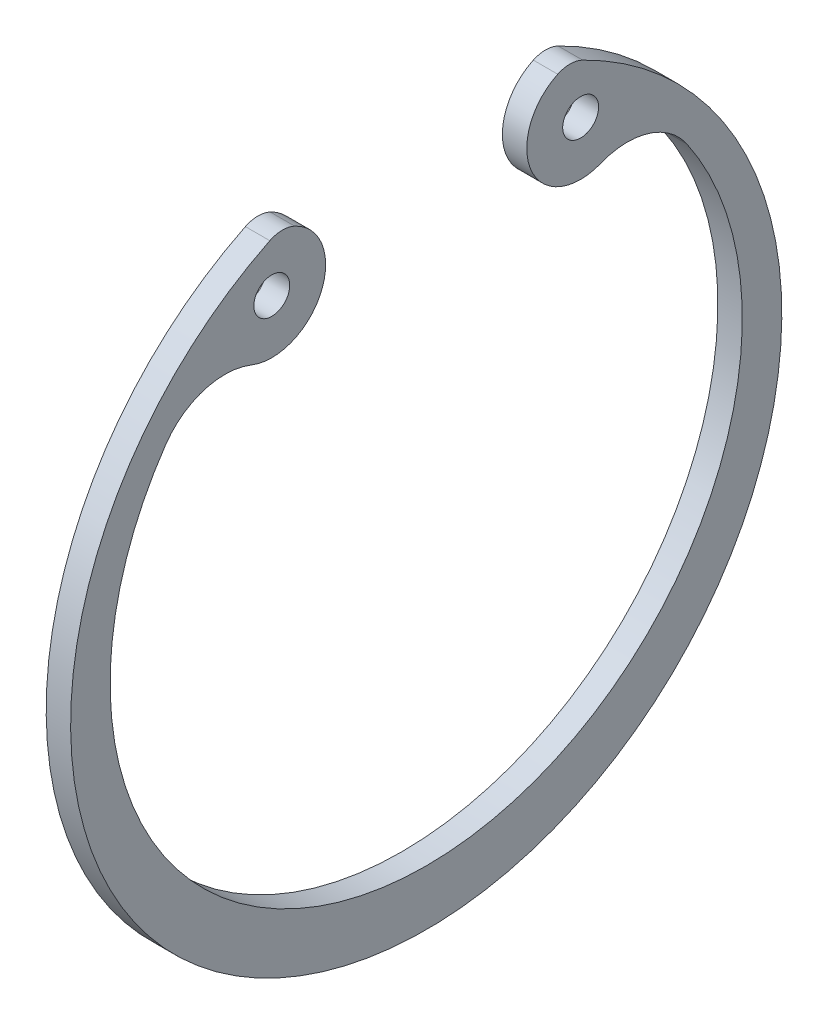
ISO-10303-21;
HEADER;
FILE_DESCRIPTION(('STEP AP214'),'2;1');
FILE_NAME('part.step','',(''),(''),'','','');
FILE_SCHEMA(('AUTOMOTIVE_DESIGN { 1 0 10303 214 1 1 1 1 }'));
ENDSEC;
DATA;
#1=APPLICATION_CONTEXT('core data for automotive mechanical design processes');
#2=APPLICATION_PROTOCOL_DEFINITION('international standard','automotive_design',2000,#1);
#3=PRODUCT_CONTEXT('',#1,'mechanical');
#4=PRODUCT('Part','Part','',(#3));
#5=PRODUCT_RELATED_PRODUCT_CATEGORY('part','',(#4));
#6=PRODUCT_DEFINITION_FORMATION('','',#4);
#7=PRODUCT_DEFINITION_CONTEXT('part definition',#1,'design');
#8=PRODUCT_DEFINITION('design','',#6,#7);
#9=PRODUCT_DEFINITION_SHAPE('','',#8);
#10=(LENGTH_UNIT() NAMED_UNIT(*) SI_UNIT(.MILLI.,.METRE.));
#11=(NAMED_UNIT(*) PLANE_ANGLE_UNIT() SI_UNIT($,.RADIAN.));
#12=(NAMED_UNIT(*) SI_UNIT($,.STERADIAN.) SOLID_ANGLE_UNIT());
#13=UNCERTAINTY_MEASURE_WITH_UNIT(LENGTH_MEASURE(1.E-05),#10,'distance_accuracy_value','');
#14=(GEOMETRIC_REPRESENTATION_CONTEXT(3) GLOBAL_UNCERTAINTY_ASSIGNED_CONTEXT((#13)) GLOBAL_UNIT_ASSIGNED_CONTEXT((#10,
#11,#12)) REPRESENTATION_CONTEXT('',''));
#15=CARTESIAN_POINT('',(0.,0.,0.));
#16=DIRECTION('',(0.,0.,1.));
#17=DIRECTION('',(1.,0.,0.));
#18=AXIS2_PLACEMENT_3D('',#15,#16,#17);
#19=CARTESIAN_POINT('',(1.7,10.2158969395902,5.0026067924304));
#20=DIRECTION('',(1.,0.,0.));
#21=DIRECTION('',(0.,0.,-1.));
#22=AXIS2_PLACEMENT_3D('',#19,#20,#21);
#23=PLANE('',#22);
#24=CARTESIAN_POINT('',(1.7,18.8492057096105,-10.7484043782289));
#25=DIRECTION('',(1.,0.,0.));
#26=DIRECTION('',(0.,0.,-1.));
#27=AXIS2_PLACEMENT_3D('',#24,#25,#26);
#28=CIRCLE('',#27,1.25);
#29=CARTESIAN_POINT('',(1.7,18.8492057096105,-11.9984043782289));
#30=VERTEX_POINT('',#29);
#31=EDGE_CURVE('E136',#30,#30,#28,.T.);
#32=ORIENTED_EDGE('',*,*,#31,.F.);
#33=EDGE_LOOP('',(#32));
#34=FACE_BOUND('',#33,.T.);
#35=CARTESIAN_POINT('',(1.7,20.4317938791805,10.0052135848608));
#36=DIRECTION('',(1.,0.,0.));
#37=DIRECTION('',(0.,0.,-1.));
#38=AXIS2_PLACEMENT_3D('',#35,#36,#37);
#39=CIRCLE('',#38,2.);
#40=CARTESIAN_POINT('',(1.7,22.2421166961173,9.15507753782008));
#41=VERTEX_POINT('',#40);
#42=CARTESIAN_POINT('',(1.7,22.2279955388887,10.8847928011123));
#43=VERTEX_POINT('',#42);
#44=EDGE_CURVE('E147',#41,#43,#39,.T.);
#45=ORIENTED_EDGE('',*,*,#44,.T.);
#46=CARTESIAN_POINT('',(1.7,0.,0.));
#47=DIRECTION('',(1.,0.,0.));
#48=DIRECTION('',(0.,0.,-1.));
#49=AXIS2_PLACEMENT_3D('',#46,#47,#48);
#50=CIRCLE('',#49,24.75);
#51=CARTESIAN_POINT('',(1.7,22.2279955388887,-10.8847928011123));
#52=VERTEX_POINT('',#51);
#53=EDGE_CURVE('E95',#43,#52,#50,.T.);
#54=ORIENTED_EDGE('',*,*,#53,.T.);
#55=CARTESIAN_POINT('',(1.7,20.4317938791805,-10.0052135848608));
#56=DIRECTION('',(1.,0.,0.));
#57=DIRECTION('',(0.,0.,1.));
#58=AXIS2_PLACEMENT_3D('',#55,#56,#57);
#59=CIRCLE('',#58,2.);
#60=CARTESIAN_POINT('',(1.7,22.2421166961173,-9.15507753782008));
#61=VERTEX_POINT('',#60);
#62=EDGE_CURVE('E162',#52,#61,#59,.T.);
#63=ORIENTED_EDGE('',*,*,#62,.T.);
#64=CARTESIAN_POINT('',(1.7,18.8492057096105,-10.7484043782289));
#65=DIRECTION('',(1.,0.,0.));
#66=DIRECTION('',(0.,0.,-1.));
#67=AXIS2_PLACEMENT_3D('',#64,#65,#66);
#68=CIRCLE('',#67,3.74840437822889);
#69=CARTESIAN_POINT('',(1.7,15.3708259706322,-12.1453330715382));
#70=VERTEX_POINT('',#69);
#71=EDGE_CURVE('E175',#61,#70,#68,.T.);
#72=ORIENTED_EDGE('',*,*,#71,.T.);
#73=CARTESIAN_POINT('',(1.7,10.7310120818465,-14.0086975225867));
#74=DIRECTION('',(-1.,0.,0.));
#75=DIRECTION('',(0.,0.,-1.));
#76=AXIS2_PLACEMENT_3D('',#73,#74,#75);
#77=CIRCLE('',#76,5.);
#78=CARTESIAN_POINT('',(1.7,13.5636626941543,-18.1289026762887));
#79=VERTEX_POINT('',#78);
#80=EDGE_CURVE('E114',#70,#79,#77,.T.);
#81=ORIENTED_EDGE('',*,*,#80,.T.);
#82=CARTESIAN_POINT('',(1.7,1.1,0.));
#83=DIRECTION('',(-1.,0.,0.));
#84=DIRECTION('',(0.,0.,-1.));
#85=AXIS2_PLACEMENT_3D('',#82,#83,#84);
#86=CIRCLE('',#85,22.);
#87=CARTESIAN_POINT('',(1.7,13.5636626941543,18.1289026762887));
#88=VERTEX_POINT('',#87);
#89=EDGE_CURVE('E108',#79,#88,#86,.T.);
#90=ORIENTED_EDGE('',*,*,#89,.T.);
#91=CARTESIAN_POINT('',(1.7,10.7310120818465,14.0086975225867));
#92=DIRECTION('',(-1.,0.,0.));
#93=DIRECTION('',(0.,0.,1.));
#94=AXIS2_PLACEMENT_3D('',#91,#92,#93);
#95=CIRCLE('',#94,5.);
#96=CARTESIAN_POINT('',(1.7,15.3708259706322,12.1453330715382));
#97=VERTEX_POINT('',#96);
#98=EDGE_CURVE('E112',#88,#97,#95,.T.);
#99=ORIENTED_EDGE('',*,*,#98,.T.);
#100=CARTESIAN_POINT('',(1.7,18.8492057096105,10.7484043782289));
#101=DIRECTION('',(1.,0.,0.));
#102=DIRECTION('',(0.,0.,1.));
#103=AXIS2_PLACEMENT_3D('',#100,#101,#102);
#104=CIRCLE('',#103,3.74840437822889);
#105=EDGE_CURVE('E52',#97,#41,#104,.T.);
#106=ORIENTED_EDGE('',*,*,#105,.T.);
#107=EDGE_LOOP('',(#45,#54,#63,#72,#81,#90,#99,#106));
#108=FACE_BOUND('',#107,.T.);
#109=CARTESIAN_POINT('',(1.7,18.8492057096105,10.7484043782289));
#110=DIRECTION('',(1.,0.,0.));
#111=DIRECTION('',(0.,0.,1.));
#112=AXIS2_PLACEMENT_3D('',#109,#110,#111);
#113=CIRCLE('',#112,1.25);
#114=CARTESIAN_POINT('',(1.7,18.8492057096105,11.9984043782289));
#115=VERTEX_POINT('',#114);
#116=EDGE_CURVE('E184',#115,#115,#113,.T.);
#117=ORIENTED_EDGE('',*,*,#116,.F.);
#118=EDGE_LOOP('',(#117));
#119=FACE_BOUND('',#118,.T.);
#120=ADVANCED_FACE('F35',(#34,#108,#119),#23,.T.);
#121=CARTESIAN_POINT('',(0.,10.2158969395902,5.0026067924304));
#122=DIRECTION('',(1.,0.,0.));
#123=DIRECTION('',(0.,0.,-1.));
#124=AXIS2_PLACEMENT_3D('',#121,#122,#123);
#125=PLANE('',#124);
#126=CARTESIAN_POINT('',(0.,20.4317938791805,10.0052135848608));
#127=DIRECTION('',(1.,0.,0.));
#128=DIRECTION('',(0.,0.,-1.));
#129=AXIS2_PLACEMENT_3D('',#126,#127,#128);
#130=CIRCLE('',#129,2.);
#131=CARTESIAN_POINT('',(0.,22.2421166961173,9.15507753782008));
#132=VERTEX_POINT('',#131);
#133=CARTESIAN_POINT('',(0.,22.2279955388887,10.8847928011123));
#134=VERTEX_POINT('',#133);
#135=EDGE_CURVE('E132',#132,#134,#130,.T.);
#136=ORIENTED_EDGE('',*,*,#135,.F.);
#137=CARTESIAN_POINT('',(0.,18.8492057096105,10.7484043782289));
#138=DIRECTION('',(1.,0.,0.));
#139=DIRECTION('',(0.,0.,1.));
#140=AXIS2_PLACEMENT_3D('',#137,#138,#139);
#141=CIRCLE('',#140,3.74840437822889);
#142=CARTESIAN_POINT('',(0.,15.3708259706322,12.1453330715382));
#143=VERTEX_POINT('',#142);
#144=EDGE_CURVE('E87',#143,#132,#141,.T.);
#145=ORIENTED_EDGE('',*,*,#144,.F.);
#146=CARTESIAN_POINT('',(0.,10.7310120818465,14.0086975225867));
#147=DIRECTION('',(-1.,0.,0.));
#148=DIRECTION('',(0.,0.,1.));
#149=AXIS2_PLACEMENT_3D('',#146,#147,#148);
#150=CIRCLE('',#149,5.);
#151=CARTESIAN_POINT('',(0.,13.5636626941543,18.1289026762887));
#152=VERTEX_POINT('',#151);
#153=EDGE_CURVE('E81',#152,#143,#150,.T.);
#154=ORIENTED_EDGE('',*,*,#153,.F.);
#155=CARTESIAN_POINT('',(0.,1.1,0.));
#156=DIRECTION('',(-1.,0.,0.));
#157=DIRECTION('',(0.,0.,-1.));
#158=AXIS2_PLACEMENT_3D('',#155,#156,#157);
#159=CIRCLE('',#158,22.);
#160=CARTESIAN_POINT('',(0.,13.5636626941543,-18.1289026762887));
#161=VERTEX_POINT('',#160);
#162=EDGE_CURVE('E122',#161,#152,#159,.T.);
#163=ORIENTED_EDGE('',*,*,#162,.F.);
#164=CARTESIAN_POINT('',(0.,10.7310120818465,-14.0086975225867));
#165=DIRECTION('',(-1.,0.,0.));
#166=DIRECTION('',(0.,0.,-1.));
#167=AXIS2_PLACEMENT_3D('',#164,#165,#166);
#168=CIRCLE('',#167,5.);
#169=CARTESIAN_POINT('',(0.,15.3708259706322,-12.1453330715382));
#170=VERTEX_POINT('',#169);
#171=EDGE_CURVE('E142',#170,#161,#168,.T.);
#172=ORIENTED_EDGE('',*,*,#171,.F.);
#173=CARTESIAN_POINT('',(0.,18.8492057096105,-10.7484043782289));
#174=DIRECTION('',(1.,0.,0.));
#175=DIRECTION('',(0.,0.,-1.));
#176=AXIS2_PLACEMENT_3D('',#173,#174,#175);
#177=CIRCLE('',#176,3.74840437822889);
#178=CARTESIAN_POINT('',(0.,22.2421166961173,-9.15507753782008));
#179=VERTEX_POINT('',#178);
#180=EDGE_CURVE('E140',#179,#170,#177,.T.);
#181=ORIENTED_EDGE('',*,*,#180,.F.);
#182=CARTESIAN_POINT('',(0.,20.4317938791805,-10.0052135848608));
#183=DIRECTION('',(1.,0.,0.));
#184=DIRECTION('',(0.,0.,1.));
#185=AXIS2_PLACEMENT_3D('',#182,#183,#184);
#186=CIRCLE('',#185,2.);
#187=CARTESIAN_POINT('',(0.,22.2279955388887,-10.8847928011123));
#188=VERTEX_POINT('',#187);
#189=EDGE_CURVE('E138',#188,#179,#186,.T.);
#190=ORIENTED_EDGE('',*,*,#189,.F.);
#191=CARTESIAN_POINT('',(0.,0.,0.));
#192=DIRECTION('',(1.,0.,0.));
#193=DIRECTION('',(0.,0.,-1.));
#194=AXIS2_PLACEMENT_3D('',#191,#192,#193);
#195=CIRCLE('',#194,24.75);
#196=EDGE_CURVE('E135',#134,#188,#195,.T.);
#197=ORIENTED_EDGE('',*,*,#196,.F.);
#198=EDGE_LOOP('',(#136,#145,#154,#163,#172,#181,#190,#197));
#199=FACE_BOUND('',#198,.T.);
#200=CARTESIAN_POINT('',(0.,18.8492057096105,-10.7484043782289));
#201=DIRECTION('',(1.,0.,0.));
#202=DIRECTION('',(0.,0.,-1.));
#203=AXIS2_PLACEMENT_3D('',#200,#201,#202);
#204=CIRCLE('',#203,1.25);
#205=CARTESIAN_POINT('',(0.,18.8492057096105,-11.9984043782289));
#206=VERTEX_POINT('',#205);
#207=EDGE_CURVE('E181',#206,#206,#204,.T.);
#208=ORIENTED_EDGE('',*,*,#207,.T.);
#209=EDGE_LOOP('',(#208));
#210=FACE_BOUND('',#209,.T.);
#211=CARTESIAN_POINT('',(0.,18.8492057096105,10.7484043782289));
#212=DIRECTION('',(1.,0.,0.));
#213=DIRECTION('',(0.,0.,1.));
#214=AXIS2_PLACEMENT_3D('',#211,#212,#213);
#215=CIRCLE('',#214,1.25);
#216=CARTESIAN_POINT('',(0.,18.8492057096105,11.9984043782289));
#217=VERTEX_POINT('',#216);
#218=EDGE_CURVE('E187',#217,#217,#215,.T.);
#219=ORIENTED_EDGE('',*,*,#218,.T.);
#220=EDGE_LOOP('',(#219));
#221=FACE_BOUND('',#220,.T.);
#222=ADVANCED_FACE('F166',(#199,#210,#221),#125,.F.);
#223=CARTESIAN_POINT('',(1.7,20.4317938791805,10.0052135848608));
#224=DIRECTION('',(-1.,0.,0.));
#225=DIRECTION('',(0.,0.,1.));
#226=AXIS2_PLACEMENT_3D('',#223,#224,#225);
#227=CYLINDRICAL_SURFACE('',#226,2.);
#228=ORIENTED_EDGE('',*,*,#135,.T.);
#229=DIRECTION('',(-1.,0.,0.));
#230=VECTOR('',#229,1.);
#231=CARTESIAN_POINT('',(1.7,22.2279955388887,10.8847928011123));
#232=LINE('',#231,#230);
#233=EDGE_CURVE('E11',#43,#134,#232,.T.);
#234=ORIENTED_EDGE('',*,*,#233,.F.);
#235=ORIENTED_EDGE('',*,*,#44,.F.);
#236=DIRECTION('',(-1.,0.,0.));
#237=VECTOR('',#236,1.);
#238=CARTESIAN_POINT('',(1.7,22.2421166961173,9.15507753782008));
#239=LINE('',#238,#237);
#240=EDGE_CURVE('E128',#41,#132,#239,.T.);
#241=ORIENTED_EDGE('',*,*,#240,.T.);
#242=EDGE_LOOP('',(#228,#234,#235,#241));
#243=FACE_BOUND('',#242,.T.);
#244=ADVANCED_FACE('F37',(#243),#227,.T.);
#245=CARTESIAN_POINT('',(1.7,0.,0.));
#246=DIRECTION('',(-1.,0.,0.));
#247=DIRECTION('',(0.,0.,1.));
#248=AXIS2_PLACEMENT_3D('',#245,#246,#247);
#249=CYLINDRICAL_SURFACE('',#248,24.75);
#250=ORIENTED_EDGE('',*,*,#196,.T.);
#251=DIRECTION('',(-1.,0.,0.));
#252=VECTOR('',#251,1.);
#253=CARTESIAN_POINT('',(1.7,22.2279955388887,-10.8847928011123));
#254=LINE('',#253,#252);
#255=EDGE_CURVE('E44',#52,#188,#254,.T.);
#256=ORIENTED_EDGE('',*,*,#255,.F.);
#257=ORIENTED_EDGE('',*,*,#53,.F.);
#258=ORIENTED_EDGE('',*,*,#233,.T.);
#259=EDGE_LOOP('',(#250,#256,#257,#258));
#260=FACE_BOUND('',#259,.T.);
#261=ADVANCED_FACE('F219',(#260),#249,.T.);
#262=CARTESIAN_POINT('',(1.7,20.4317938791805,-10.0052135848608));
#263=DIRECTION('',(-1.,0.,0.));
#264=DIRECTION('',(0.,0.,1.));
#265=AXIS2_PLACEMENT_3D('',#262,#263,#264);
#266=CYLINDRICAL_SURFACE('',#265,2.);
#267=ORIENTED_EDGE('',*,*,#189,.T.);
#268=DIRECTION('',(-1.,0.,0.));
#269=VECTOR('',#268,1.);
#270=CARTESIAN_POINT('',(1.7,22.2421166961173,-9.15507753782008));
#271=LINE('',#270,#269);
#272=EDGE_CURVE('E154',#61,#179,#271,.T.);
#273=ORIENTED_EDGE('',*,*,#272,.F.);
#274=ORIENTED_EDGE('',*,*,#62,.F.);
#275=ORIENTED_EDGE('',*,*,#255,.T.);
#276=EDGE_LOOP('',(#267,#273,#274,#275));
#277=FACE_BOUND('',#276,.T.);
#278=ADVANCED_FACE('F160',(#277),#266,.T.);
#279=CARTESIAN_POINT('',(1.7,18.8492057096105,-10.7484043782289));
#280=DIRECTION('',(-1.,0.,0.));
#281=DIRECTION('',(0.,0.,1.));
#282=AXIS2_PLACEMENT_3D('',#279,#280,#281);
#283=CYLINDRICAL_SURFACE('',#282,3.74840437822889);
#284=ORIENTED_EDGE('',*,*,#180,.T.);
#285=DIRECTION('',(-1.,0.,0.));
#286=VECTOR('',#285,1.);
#287=CARTESIAN_POINT('',(1.7,15.3708259706322,-12.1453330715382));
#288=LINE('',#287,#286);
#289=EDGE_CURVE('E151',#70,#170,#288,.T.);
#290=ORIENTED_EDGE('',*,*,#289,.F.);
#291=ORIENTED_EDGE('',*,*,#71,.F.);
#292=ORIENTED_EDGE('',*,*,#272,.T.);
#293=EDGE_LOOP('',(#284,#290,#291,#292));
#294=FACE_BOUND('',#293,.T.);
#295=ADVANCED_FACE('F171',(#294),#283,.T.);
#296=CARTESIAN_POINT('',(1.7,10.7310120818465,-14.0086975225867));
#297=DIRECTION('',(-1.,0.,0.));
#298=DIRECTION('',(0.,0.,1.));
#299=AXIS2_PLACEMENT_3D('',#296,#297,#298);
#300=CYLINDRICAL_SURFACE('',#299,5.);
#301=ORIENTED_EDGE('',*,*,#171,.T.);
#302=DIRECTION('',(-1.,0.,0.));
#303=VECTOR('',#302,1.);
#304=CARTESIAN_POINT('',(1.7,13.5636626941543,-18.1289026762887));
#305=LINE('',#304,#303);
#306=EDGE_CURVE('E123',#79,#161,#305,.T.);
#307=ORIENTED_EDGE('',*,*,#306,.F.);
#308=ORIENTED_EDGE('',*,*,#80,.F.);
#309=ORIENTED_EDGE('',*,*,#289,.T.);
#310=EDGE_LOOP('',(#301,#307,#308,#309));
#311=FACE_BOUND('',#310,.T.);
#312=ADVANCED_FACE('F174',(#311),#300,.F.);
#313=CARTESIAN_POINT('',(1.7,1.1,0.));
#314=DIRECTION('',(-1.,0.,0.));
#315=DIRECTION('',(0.,0.,1.));
#316=AXIS2_PLACEMENT_3D('',#313,#314,#315);
#317=CYLINDRICAL_SURFACE('',#316,22.);
#318=ORIENTED_EDGE('',*,*,#162,.T.);
#319=DIRECTION('',(-1.,0.,0.));
#320=VECTOR('',#319,1.);
#321=CARTESIAN_POINT('',(1.7,13.5636626941543,18.1289026762887));
#322=LINE('',#321,#320);
#323=EDGE_CURVE('E119',#88,#152,#322,.T.);
#324=ORIENTED_EDGE('',*,*,#323,.F.);
#325=ORIENTED_EDGE('',*,*,#89,.F.);
#326=ORIENTED_EDGE('',*,*,#306,.T.);
#327=EDGE_LOOP('',(#318,#324,#325,#326));
#328=FACE_BOUND('',#327,.T.);
#329=ADVANCED_FACE('F120',(#328),#317,.F.);
#330=CARTESIAN_POINT('',(1.7,10.7310120818465,14.0086975225867));
#331=DIRECTION('',(-1.,0.,0.));
#332=DIRECTION('',(0.,0.,1.));
#333=AXIS2_PLACEMENT_3D('',#330,#331,#332);
#334=CYLINDRICAL_SURFACE('',#333,5.);
#335=ORIENTED_EDGE('',*,*,#153,.T.);
#336=DIRECTION('',(-1.,0.,0.));
#337=VECTOR('',#336,1.);
#338=CARTESIAN_POINT('',(1.7,15.3708259706322,12.1453330715382));
#339=LINE('',#338,#337);
#340=EDGE_CURVE('E124',#97,#143,#339,.T.);
#341=ORIENTED_EDGE('',*,*,#340,.F.);
#342=ORIENTED_EDGE('',*,*,#98,.F.);
#343=ORIENTED_EDGE('',*,*,#323,.T.);
#344=EDGE_LOOP('',(#335,#341,#342,#343));
#345=FACE_BOUND('',#344,.T.);
#346=ADVANCED_FACE('F126',(#345),#334,.F.);
#347=CARTESIAN_POINT('',(1.7,18.8492057096105,10.7484043782289));
#348=DIRECTION('',(-1.,0.,0.));
#349=DIRECTION('',(0.,0.,1.));
#350=AXIS2_PLACEMENT_3D('',#347,#348,#349);
#351=CYLINDRICAL_SURFACE('',#350,3.74840437822889);
#352=ORIENTED_EDGE('',*,*,#144,.T.);
#353=ORIENTED_EDGE('',*,*,#240,.F.);
#354=ORIENTED_EDGE('',*,*,#105,.F.);
#355=ORIENTED_EDGE('',*,*,#340,.T.);
#356=EDGE_LOOP('',(#352,#353,#354,#355));
#357=FACE_BOUND('',#356,.T.);
#358=ADVANCED_FACE('F207',(#357),#351,.T.);
#359=CARTESIAN_POINT('',(1.7,18.8492057096105,-10.7484043782289));
#360=DIRECTION('',(-1.,0.,0.));
#361=DIRECTION('',(0.,0.,1.));
#362=AXIS2_PLACEMENT_3D('',#359,#360,#361);
#363=CYLINDRICAL_SURFACE('',#362,1.25);
#364=ORIENTED_EDGE('',*,*,#31,.T.);
#365=EDGE_LOOP('',(#364));
#366=FACE_BOUND('',#365,.T.);
#367=ORIENTED_EDGE('',*,*,#207,.F.);
#368=EDGE_LOOP('',(#367));
#369=FACE_BOUND('',#368,.T.);
#370=ADVANCED_FACE('F204',(#366,#369),#363,.F.);
#371=CARTESIAN_POINT('',(1.7,18.8492057096105,10.7484043782289));
#372=DIRECTION('',(-1.,0.,0.));
#373=DIRECTION('',(0.,0.,1.));
#374=AXIS2_PLACEMENT_3D('',#371,#372,#373);
#375=CYLINDRICAL_SURFACE('',#374,1.25);
#376=ORIENTED_EDGE('',*,*,#116,.T.);
#377=EDGE_LOOP('',(#376));
#378=FACE_BOUND('',#377,.T.);
#379=ORIENTED_EDGE('',*,*,#218,.F.);
#380=EDGE_LOOP('',(#379));
#381=FACE_BOUND('',#380,.T.);
#382=ADVANCED_FACE('F193',(#378,#381),#375,.F.);
#383=CLOSED_SHELL('',(#120,#222,#244,#261,#278,#295,#312,#329,#346,#358,#370,#382));
#384=MANIFOLD_SOLID_BREP('B2',#383);
#385=ADVANCED_BREP_SHAPE_REPRESENTATION('',(#18,#384),#14);
#386=SHAPE_DEFINITION_REPRESENTATION(#9,#385);
ENDSEC;
END-ISO-10303-21;
